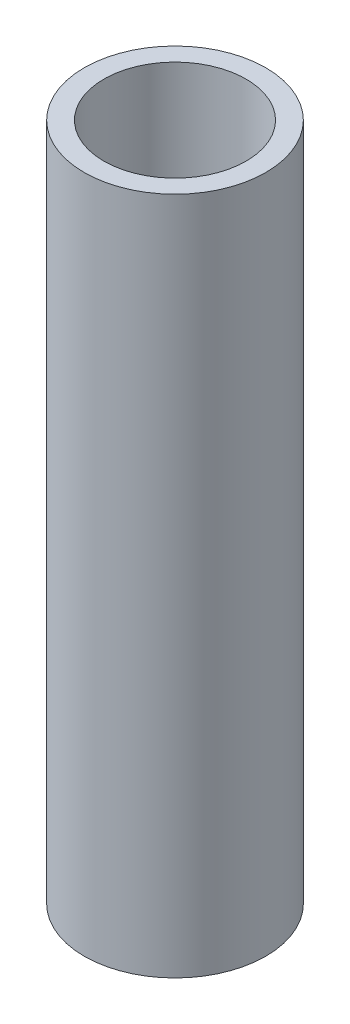
ISO-10303-21;
HEADER;
FILE_DESCRIPTION(('STEP AP214'),'2;1');
FILE_NAME('part.step','',(''),(''),'','','');
FILE_SCHEMA(('AUTOMOTIVE_DESIGN { 1 0 10303 214 1 1 1 1 }'));
ENDSEC;
DATA;
#1=APPLICATION_CONTEXT('core data for automotive mechanical design processes');
#2=APPLICATION_PROTOCOL_DEFINITION('international standard','automotive_design',2000,#1);
#3=PRODUCT_CONTEXT('',#1,'mechanical');
#4=PRODUCT('Part','Part','',(#3));
#5=PRODUCT_RELATED_PRODUCT_CATEGORY('part','',(#4));
#6=PRODUCT_DEFINITION_FORMATION('','',#4);
#7=PRODUCT_DEFINITION_CONTEXT('part definition',#1,'design');
#8=PRODUCT_DEFINITION('design','',#6,#7);
#9=PRODUCT_DEFINITION_SHAPE('','',#8);
#10=(LENGTH_UNIT() NAMED_UNIT(*) SI_UNIT(.MILLI.,.METRE.));
#11=(NAMED_UNIT(*) PLANE_ANGLE_UNIT() SI_UNIT($,.RADIAN.));
#12=(NAMED_UNIT(*) SI_UNIT($,.STERADIAN.) SOLID_ANGLE_UNIT());
#13=UNCERTAINTY_MEASURE_WITH_UNIT(LENGTH_MEASURE(1.E-05),#10,'distance_accuracy_value','');
#14=(GEOMETRIC_REPRESENTATION_CONTEXT(3) GLOBAL_UNCERTAINTY_ASSIGNED_CONTEXT((#13)) GLOBAL_UNIT_ASSIGNED_CONTEXT((#10,
#11,#12)) REPRESENTATION_CONTEXT('',''));
#15=CARTESIAN_POINT('',(0.,0.,0.));
#16=DIRECTION('',(0.,0.,1.));
#17=DIRECTION('',(1.,0.,0.));
#18=AXIS2_PLACEMENT_3D('',#15,#16,#17);
#19=CARTESIAN_POINT('',(0.,99.9998,0.));
#20=DIRECTION('',(0.,1.,0.));
#21=DIRECTION('',(0.,0.,1.));
#22=AXIS2_PLACEMENT_3D('',#19,#20,#21);
#23=PLANE('',#22);
#24=CARTESIAN_POINT('',(0.,99.9998,0.));
#25=DIRECTION('',(0.,1.,0.));
#26=DIRECTION('',(0.,0.,1.));
#27=AXIS2_PLACEMENT_3D('',#24,#25,#26);
#28=CIRCLE('',#27,13.3731);
#29=CARTESIAN_POINT('',(0.,99.9998,13.3731));
#30=VERTEX_POINT('',#29);
#31=EDGE_CURVE('E10',#30,#30,#28,.T.);
#32=ORIENTED_EDGE('',*,*,#31,.T.);
#33=EDGE_LOOP('',(#32));
#34=FACE_BOUND('',#33,.T.);
#35=CARTESIAN_POINT('',(0.,99.9998,0.));
#36=DIRECTION('',(0.,1.,0.));
#37=DIRECTION('',(0.,0.,1.));
#38=AXIS2_PLACEMENT_3D('',#35,#36,#37);
#39=CIRCLE('',#38,10.4775);
#40=CARTESIAN_POINT('',(0.,99.9998,10.4775));
#41=VERTEX_POINT('',#40);
#42=EDGE_CURVE('E44',#41,#41,#39,.T.);
#43=ORIENTED_EDGE('',*,*,#42,.F.);
#44=EDGE_LOOP('',(#43));
#45=FACE_BOUND('',#44,.T.);
#46=ADVANCED_FACE('F33',(#34,#45),#23,.T.);
#47=CARTESIAN_POINT('',(0.,0.,0.));
#48=DIRECTION('',(0.,1.,0.));
#49=DIRECTION('',(0.,0.,1.));
#50=AXIS2_PLACEMENT_3D('',#47,#48,#49);
#51=PLANE('',#50);
#52=CARTESIAN_POINT('',(0.,0.,0.));
#53=DIRECTION('',(0.,1.,0.));
#54=DIRECTION('',(0.,0.,1.));
#55=AXIS2_PLACEMENT_3D('',#52,#53,#54);
#56=CIRCLE('',#55,13.3731);
#57=CARTESIAN_POINT('',(0.,0.,13.3731));
#58=VERTEX_POINT('',#57);
#59=EDGE_CURVE('E37',#58,#58,#56,.T.);
#60=ORIENTED_EDGE('',*,*,#59,.F.);
#61=EDGE_LOOP('',(#60));
#62=FACE_BOUND('',#61,.T.);
#63=CARTESIAN_POINT('',(0.,0.,0.));
#64=DIRECTION('',(0.,1.,0.));
#65=DIRECTION('',(0.,0.,1.));
#66=AXIS2_PLACEMENT_3D('',#63,#64,#65);
#67=CIRCLE('',#66,10.4775);
#68=CARTESIAN_POINT('',(0.,0.,10.4775));
#69=VERTEX_POINT('',#68);
#70=EDGE_CURVE('E46',#69,#69,#67,.T.);
#71=ORIENTED_EDGE('',*,*,#70,.T.);
#72=EDGE_LOOP('',(#71));
#73=FACE_BOUND('',#72,.T.);
#74=ADVANCED_FACE('F56',(#62,#73),#51,.F.);
#75=CARTESIAN_POINT('',(0.,99.9998,0.));
#76=DIRECTION('',(0.,-1.,0.));
#77=DIRECTION('',(0.,0.,-1.));
#78=AXIS2_PLACEMENT_3D('',#75,#76,#77);
#79=CYLINDRICAL_SURFACE('',#78,13.3731);
#80=ORIENTED_EDGE('',*,*,#31,.F.);
#81=EDGE_LOOP('',(#80));
#82=FACE_BOUND('',#81,.T.);
#83=ORIENTED_EDGE('',*,*,#59,.T.);
#84=EDGE_LOOP('',(#83));
#85=FACE_BOUND('',#84,.T.);
#86=ADVANCED_FACE('F35',(#82,#85),#79,.T.);
#87=CARTESIAN_POINT('',(0.,99.9998,0.));
#88=DIRECTION('',(0.,-1.,0.));
#89=DIRECTION('',(0.,0.,-1.));
#90=AXIS2_PLACEMENT_3D('',#87,#88,#89);
#91=CYLINDRICAL_SURFACE('',#90,10.4775);
#92=ORIENTED_EDGE('',*,*,#42,.T.);
#93=EDGE_LOOP('',(#92));
#94=FACE_BOUND('',#93,.T.);
#95=ORIENTED_EDGE('',*,*,#70,.F.);
#96=EDGE_LOOP('',(#95));
#97=FACE_BOUND('',#96,.T.);
#98=ADVANCED_FACE('F52',(#94,#97),#91,.F.);
#99=CLOSED_SHELL('',(#46,#74,#86,#98));
#100=MANIFOLD_SOLID_BREP('B2',#99);
#101=ADVANCED_BREP_SHAPE_REPRESENTATION('',(#18,#100),#14);
#102=SHAPE_DEFINITION_REPRESENTATION(#9,#101);
ENDSEC;
END-ISO-10303-21;
